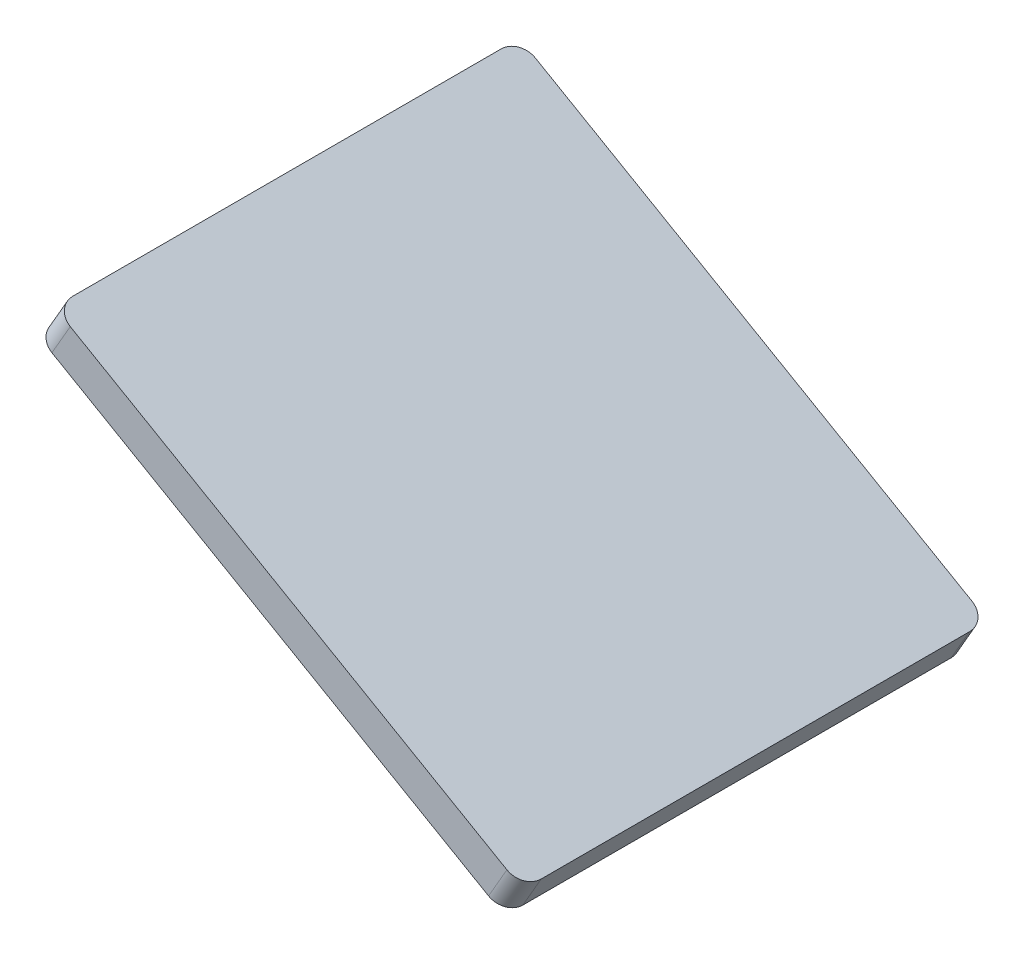
ISO-10303-21;
HEADER;
FILE_DESCRIPTION(('STEP AP214'),'2;1');
FILE_NAME('part.step','',(''),(''),'','','');
FILE_SCHEMA(('AUTOMOTIVE_DESIGN { 1 0 10303 214 1 1 1 1 }'));
ENDSEC;
DATA;
#1=APPLICATION_CONTEXT('core data for automotive mechanical design processes');
#2=APPLICATION_PROTOCOL_DEFINITION('international standard','automotive_design',2000,#1);
#3=PRODUCT_CONTEXT('',#1,'mechanical');
#4=PRODUCT('Part','Part','',(#3));
#5=PRODUCT_RELATED_PRODUCT_CATEGORY('part','',(#4));
#6=PRODUCT_DEFINITION_FORMATION('','',#4);
#7=PRODUCT_DEFINITION_CONTEXT('part definition',#1,'design');
#8=PRODUCT_DEFINITION('design','',#6,#7);
#9=PRODUCT_DEFINITION_SHAPE('','',#8);
#10=(LENGTH_UNIT() NAMED_UNIT(*) SI_UNIT(.MILLI.,.METRE.));
#11=(NAMED_UNIT(*) PLANE_ANGLE_UNIT() SI_UNIT($,.RADIAN.));
#12=(NAMED_UNIT(*) SI_UNIT($,.STERADIAN.) SOLID_ANGLE_UNIT());
#13=UNCERTAINTY_MEASURE_WITH_UNIT(LENGTH_MEASURE(1.E-05),#10,'distance_accuracy_value','');
#14=(GEOMETRIC_REPRESENTATION_CONTEXT(3) GLOBAL_UNCERTAINTY_ASSIGNED_CONTEXT((#13)) GLOBAL_UNIT_ASSIGNED_CONTEXT((#10,
#11,#12)) REPRESENTATION_CONTEXT('',''));
#15=CARTESIAN_POINT('',(0.,0.,0.));
#16=DIRECTION('',(0.,0.,1.));
#17=DIRECTION('',(1.,0.,0.));
#18=AXIS2_PLACEMENT_3D('',#15,#16,#17);
#19=CARTESIAN_POINT('',(784.669872981079,3111.50813088753,-35.));
#20=DIRECTION('',(-0.499999999999994,-0.866025403784442,0.));
#21=DIRECTION('',(0.866025403784442,-0.499999999999994,0.));
#22=AXIS2_PLACEMENT_3D('',#19,#20,#21);
#23=CYLINDRICAL_SURFACE('',#22,3.00000000000002);
#24=CARTESIAN_POINT('',(781.669872981079,3106.31197846482,-35.));
#25=DIRECTION('',(0.499999999999994,0.866025403784442,0.));
#26=DIRECTION('',(-0.866025403784442,0.499999999999994,0.));
#27=AXIS2_PLACEMENT_3D('',#24,#25,#26);
#28=CIRCLE('',#27,3.00000000000002);
#29=CARTESIAN_POINT('',(784.267949192432,3104.81197846482,-35.));
#30=VERTEX_POINT('',#29);
#31=CARTESIAN_POINT('',(781.669872981079,3106.31197846482,-38.));
#32=VERTEX_POINT('',#31);
#33=EDGE_CURVE('E136',#30,#32,#28,.T.);
#34=ORIENTED_EDGE('',*,*,#33,.T.);
#35=DIRECTION('',(-0.499999999999994,-0.866025403784442,0.));
#36=VECTOR('',#35,1.);
#37=CARTESIAN_POINT('',(784.669872981079,3111.50813088753,-38.));
#38=LINE('',#37,#36);
#39=CARTESIAN_POINT('',(784.669872981079,3111.50813088753,-38.));
#40=VERTEX_POINT('',#39);
#41=EDGE_CURVE('E11',#40,#32,#38,.T.);
#42=ORIENTED_EDGE('',*,*,#41,.F.);
#43=CARTESIAN_POINT('',(784.669872981079,3111.50813088753,-35.));
#44=DIRECTION('',(0.499999999999994,0.866025403784442,0.));
#45=DIRECTION('',(-0.866025403784442,0.499999999999994,0.));
#46=AXIS2_PLACEMENT_3D('',#43,#44,#45);
#47=CIRCLE('',#46,3.00000000000002);
#48=CARTESIAN_POINT('',(787.267949192432,3110.00813088753,-35.));
#49=VERTEX_POINT('',#48);
#50=EDGE_CURVE('E150',#49,#40,#47,.T.);
#51=ORIENTED_EDGE('',*,*,#50,.F.);
#52=DIRECTION('',(-0.499999999999994,-0.866025403784442,0.));
#53=VECTOR('',#52,1.);
#54=CARTESIAN_POINT('',(787.267949192432,3110.00813088753,-35.));
#55=LINE('',#54,#53);
#56=EDGE_CURVE('E132',#49,#30,#55,.T.);
#57=ORIENTED_EDGE('',*,*,#56,.T.);
#58=EDGE_LOOP('',(#34,#42,#51,#57));
#59=FACE_BOUND('',#58,.T.);
#60=ADVANCED_FACE('F40',(#59),#23,.T.);
#61=CARTESIAN_POINT('',(713.330127018923,3152.6961524227,-38.));
#62=DIRECTION('',(0.,0.,1.));
#63=DIRECTION('',(1.,0.,0.));
#64=AXIS2_PLACEMENT_3D('',#61,#62,#63);
#65=PLANE('',#64);
#66=DIRECTION('',(-0.866025403784442,0.499999999999994,0.));
#67=VECTOR('',#66,1.);
#68=CARTESIAN_POINT('',(710.330127018923,3147.49999999999,-38.));
#69=LINE('',#68,#67);
#70=CARTESIAN_POINT('',(710.330127018923,3147.49999999999,-38.));
#71=VERTEX_POINT('',#70);
#72=EDGE_CURVE('E139',#32,#71,#69,.T.);
#73=ORIENTED_EDGE('',*,*,#72,.T.);
#74=DIRECTION('',(-0.499999999999994,-0.866025403784442,0.));
#75=VECTOR('',#74,1.);
#76=CARTESIAN_POINT('',(713.330127018923,3152.6961524227,-38.));
#77=LINE('',#76,#75);
#78=CARTESIAN_POINT('',(713.330127018923,3152.6961524227,-38.));
#79=VERTEX_POINT('',#78);
#80=EDGE_CURVE('E48',#79,#71,#77,.T.);
#81=ORIENTED_EDGE('',*,*,#80,.F.);
#82=DIRECTION('',(-0.866025403784442,0.499999999999994,0.));
#83=VECTOR('',#82,1.);
#84=CARTESIAN_POINT('',(713.330127018923,3152.6961524227,-38.));
#85=LINE('',#84,#83);
#86=EDGE_CURVE('E99',#40,#79,#85,.T.);
#87=ORIENTED_EDGE('',*,*,#86,.F.);
#88=ORIENTED_EDGE('',*,*,#41,.T.);
#89=EDGE_LOOP('',(#73,#81,#87,#88));
#90=FACE_BOUND('',#89,.T.);
#91=ADVANCED_FACE('F185',(#90),#65,.F.);
#92=CARTESIAN_POINT('',(713.330127018923,3152.6961524227,-35.));
#93=DIRECTION('',(-0.499999999999994,-0.866025403784442,0.));
#94=DIRECTION('',(0.866025403784442,-0.499999999999994,0.));
#95=AXIS2_PLACEMENT_3D('',#92,#93,#94);
#96=CYLINDRICAL_SURFACE('',#95,3.00000000000002);
#97=CARTESIAN_POINT('',(710.330127018923,3147.49999999999,-35.));
#98=DIRECTION('',(0.499999999999994,0.866025403784442,0.));
#99=DIRECTION('',(0.866025403784442,-0.499999999999994,0.));
#100=AXIS2_PLACEMENT_3D('',#97,#98,#99);
#101=CIRCLE('',#100,3.00000000000002);
#102=CARTESIAN_POINT('',(707.73205080757,3148.99999999999,-35.));
#103=VERTEX_POINT('',#102);
#104=EDGE_CURVE('E141',#71,#103,#101,.T.);
#105=ORIENTED_EDGE('',*,*,#104,.T.);
#106=DIRECTION('',(-0.499999999999994,-0.866025403784442,0.));
#107=VECTOR('',#106,1.);
#108=CARTESIAN_POINT('',(710.73205080757,3154.1961524227,-35.));
#109=LINE('',#108,#107);
#110=CARTESIAN_POINT('',(710.73205080757,3154.1961524227,-35.));
#111=VERTEX_POINT('',#110);
#112=EDGE_CURVE('E157',#111,#103,#109,.T.);
#113=ORIENTED_EDGE('',*,*,#112,.F.);
#114=CARTESIAN_POINT('',(713.330127018923,3152.6961524227,-35.));
#115=DIRECTION('',(0.499999999999994,0.866025403784442,0.));
#116=DIRECTION('',(0.866025403784442,-0.499999999999994,0.));
#117=AXIS2_PLACEMENT_3D('',#114,#115,#116);
#118=CIRCLE('',#117,3.00000000000002);
#119=EDGE_CURVE('E165',#79,#111,#118,.T.);
#120=ORIENTED_EDGE('',*,*,#119,.F.);
#121=ORIENTED_EDGE('',*,*,#80,.T.);
#122=EDGE_LOOP('',(#105,#113,#120,#121));
#123=FACE_BOUND('',#122,.T.);
#124=ADVANCED_FACE('F163',(#123),#96,.T.);
#125=CARTESIAN_POINT('',(710.73205080757,3154.1961524227,-35.));
#126=DIRECTION('',(0.866025403784442,-0.499999999999994,0.));
#127=DIRECTION('',(0.499999999999994,0.866025403784442,0.));
#128=AXIS2_PLACEMENT_3D('',#125,#126,#127);
#129=PLANE('',#128);
#130=DIRECTION('',(0.,0.,1.));
#131=VECTOR('',#130,1.);
#132=CARTESIAN_POINT('',(707.73205080757,3148.99999999999,-35.));
#133=LINE('',#132,#131);
#134=CARTESIAN_POINT('',(707.73205080757,3148.99999999999,35.));
#135=VERTEX_POINT('',#134);
#136=EDGE_CURVE('E143',#103,#135,#133,.T.);
#137=ORIENTED_EDGE('',*,*,#136,.T.);
#138=DIRECTION('',(-0.499999999999994,-0.866025403784442,0.));
#139=VECTOR('',#138,1.);
#140=CARTESIAN_POINT('',(710.73205080757,3154.1961524227,35.));
#141=LINE('',#140,#139);
#142=CARTESIAN_POINT('',(710.73205080757,3154.1961524227,35.));
#143=VERTEX_POINT('',#142);
#144=EDGE_CURVE('E154',#143,#135,#141,.T.);
#145=ORIENTED_EDGE('',*,*,#144,.F.);
#146=DIRECTION('',(0.,0.,1.));
#147=VECTOR('',#146,1.);
#148=CARTESIAN_POINT('',(710.73205080757,3154.1961524227,-35.));
#149=LINE('',#148,#147);
#150=EDGE_CURVE('E177',#111,#143,#149,.T.);
#151=ORIENTED_EDGE('',*,*,#150,.F.);
#152=ORIENTED_EDGE('',*,*,#112,.T.);
#153=EDGE_LOOP('',(#137,#145,#151,#152));
#154=FACE_BOUND('',#153,.T.);
#155=ADVANCED_FACE('F173',(#154),#129,.F.);
#156=CARTESIAN_POINT('',(713.330127018923,3152.6961524227,35.));
#157=DIRECTION('',(-0.499999999999994,-0.866025403784442,0.));
#158=DIRECTION('',(0.866025403784442,-0.499999999999994,0.));
#159=AXIS2_PLACEMENT_3D('',#156,#157,#158);
#160=CYLINDRICAL_SURFACE('',#159,3.00000000000002);
#161=CARTESIAN_POINT('',(710.330127018923,3147.49999999999,35.));
#162=DIRECTION('',(0.499999999999994,0.866025403784442,0.));
#163=DIRECTION('',(0.866025403784442,-0.499999999999994,0.));
#164=AXIS2_PLACEMENT_3D('',#161,#162,#163);
#165=CIRCLE('',#164,3.00000000000002);
#166=CARTESIAN_POINT('',(710.330127018923,3147.49999999999,38.));
#167=VERTEX_POINT('',#166);
#168=EDGE_CURVE('E145',#135,#167,#165,.T.);
#169=ORIENTED_EDGE('',*,*,#168,.T.);
#170=DIRECTION('',(-0.499999999999994,-0.866025403784442,0.));
#171=VECTOR('',#170,1.);
#172=CARTESIAN_POINT('',(713.330127018923,3152.6961524227,38.));
#173=LINE('',#172,#171);
#174=CARTESIAN_POINT('',(713.330127018923,3152.6961524227,38.));
#175=VERTEX_POINT('',#174);
#176=EDGE_CURVE('E127',#175,#167,#173,.T.);
#177=ORIENTED_EDGE('',*,*,#176,.F.);
#178=CARTESIAN_POINT('',(713.330127018923,3152.6961524227,35.));
#179=DIRECTION('',(0.499999999999994,0.866025403784442,0.));
#180=DIRECTION('',(0.866025403784442,-0.499999999999994,0.));
#181=AXIS2_PLACEMENT_3D('',#178,#179,#180);
#182=CIRCLE('',#181,3.00000000000002);
#183=EDGE_CURVE('E118',#143,#175,#182,.T.);
#184=ORIENTED_EDGE('',*,*,#183,.F.);
#185=ORIENTED_EDGE('',*,*,#144,.T.);
#186=EDGE_LOOP('',(#169,#177,#184,#185));
#187=FACE_BOUND('',#186,.T.);
#188=ADVANCED_FACE('F176',(#187),#160,.T.);
#189=CARTESIAN_POINT('',(713.330127018923,3152.6961524227,38.));
#190=DIRECTION('',(0.,0.,-1.));
#191=DIRECTION('',(-1.,0.,0.));
#192=AXIS2_PLACEMENT_3D('',#189,#190,#191);
#193=PLANE('',#192);
#194=DIRECTION('',(0.866025403784442,-0.499999999999994,0.));
#195=VECTOR('',#194,1.);
#196=CARTESIAN_POINT('',(710.330127018923,3147.49999999999,38.));
#197=LINE('',#196,#195);
#198=CARTESIAN_POINT('',(781.669872981079,3106.31197846482,38.));
#199=VERTEX_POINT('',#198);
#200=EDGE_CURVE('E126',#167,#199,#197,.T.);
#201=ORIENTED_EDGE('',*,*,#200,.T.);
#202=DIRECTION('',(-0.499999999999994,-0.866025403784442,0.));
#203=VECTOR('',#202,1.);
#204=CARTESIAN_POINT('',(784.669872981079,3111.50813088753,38.));
#205=LINE('',#204,#203);
#206=CARTESIAN_POINT('',(784.669872981079,3111.50813088753,38.));
#207=VERTEX_POINT('',#206);
#208=EDGE_CURVE('E123',#207,#199,#205,.T.);
#209=ORIENTED_EDGE('',*,*,#208,.F.);
#210=DIRECTION('',(0.866025403784442,-0.499999999999994,0.));
#211=VECTOR('',#210,1.);
#212=CARTESIAN_POINT('',(713.330127018923,3152.6961524227,38.));
#213=LINE('',#212,#211);
#214=EDGE_CURVE('E112',#175,#207,#213,.T.);
#215=ORIENTED_EDGE('',*,*,#214,.F.);
#216=ORIENTED_EDGE('',*,*,#176,.T.);
#217=EDGE_LOOP('',(#201,#209,#215,#216));
#218=FACE_BOUND('',#217,.T.);
#219=ADVANCED_FACE('F124',(#218),#193,.F.);
#220=CARTESIAN_POINT('',(784.669872981079,3111.50813088753,35.));
#221=DIRECTION('',(-0.499999999999994,-0.866025403784442,0.));
#222=DIRECTION('',(0.866025403784442,-0.499999999999994,0.));
#223=AXIS2_PLACEMENT_3D('',#220,#221,#222);
#224=CYLINDRICAL_SURFACE('',#223,3.00000000000002);
#225=CARTESIAN_POINT('',(781.669872981079,3106.31197846482,35.));
#226=DIRECTION('',(0.499999999999994,0.866025403784442,0.));
#227=DIRECTION('',(0.866025403784442,-0.499999999999994,0.));
#228=AXIS2_PLACEMENT_3D('',#225,#226,#227);
#229=CIRCLE('',#228,3.00000000000002);
#230=CARTESIAN_POINT('',(784.267949192432,3104.81197846482,35.));
#231=VERTEX_POINT('',#230);
#232=EDGE_CURVE('E85',#199,#231,#229,.T.);
#233=ORIENTED_EDGE('',*,*,#232,.T.);
#234=DIRECTION('',(-0.499999999999994,-0.866025403784442,0.));
#235=VECTOR('',#234,1.);
#236=CARTESIAN_POINT('',(787.267949192432,3110.00813088753,35.));
#237=LINE('',#236,#235);
#238=CARTESIAN_POINT('',(787.267949192432,3110.00813088753,35.));
#239=VERTEX_POINT('',#238);
#240=EDGE_CURVE('E128',#239,#231,#237,.T.);
#241=ORIENTED_EDGE('',*,*,#240,.F.);
#242=CARTESIAN_POINT('',(784.669872981079,3111.50813088753,35.));
#243=DIRECTION('',(0.499999999999994,0.866025403784442,0.));
#244=DIRECTION('',(0.866025403784442,-0.499999999999994,0.));
#245=AXIS2_PLACEMENT_3D('',#242,#243,#244);
#246=CIRCLE('',#245,3.00000000000002);
#247=EDGE_CURVE('E116',#207,#239,#246,.T.);
#248=ORIENTED_EDGE('',*,*,#247,.F.);
#249=ORIENTED_EDGE('',*,*,#208,.T.);
#250=EDGE_LOOP('',(#233,#241,#248,#249));
#251=FACE_BOUND('',#250,.T.);
#252=ADVANCED_FACE('F130',(#251),#224,.T.);
#253=CARTESIAN_POINT('',(787.267949192432,3110.00813088753,-35.));
#254=DIRECTION('',(-0.866025403784442,0.499999999999994,0.));
#255=DIRECTION('',(-0.499999999999994,-0.866025403784442,0.));
#256=AXIS2_PLACEMENT_3D('',#253,#254,#255);
#257=PLANE('',#256);
#258=DIRECTION('',(0.,0.,-1.));
#259=VECTOR('',#258,1.);
#260=CARTESIAN_POINT('',(784.267949192432,3104.81197846482,-35.));
#261=LINE('',#260,#259);
#262=EDGE_CURVE('E91',#231,#30,#261,.T.);
#263=ORIENTED_EDGE('',*,*,#262,.T.);
#264=ORIENTED_EDGE('',*,*,#56,.F.);
#265=DIRECTION('',(0.,0.,-1.));
#266=VECTOR('',#265,1.);
#267=CARTESIAN_POINT('',(787.267949192432,3110.00813088753,-35.));
#268=LINE('',#267,#266);
#269=EDGE_CURVE('E56',#239,#49,#268,.T.);
#270=ORIENTED_EDGE('',*,*,#269,.F.);
#271=ORIENTED_EDGE('',*,*,#240,.T.);
#272=EDGE_LOOP('',(#263,#264,#270,#271));
#273=FACE_BOUND('',#272,.T.);
#274=ADVANCED_FACE('F201',(#273),#257,.F.);
#275=CARTESIAN_POINT('',(784.669872981079,3111.50813088753,-35.));
#276=DIRECTION('',(0.499999999999994,0.866025403784442,0.));
#277=DIRECTION('',(-0.866025403784442,0.499999999999994,0.));
#278=AXIS2_PLACEMENT_3D('',#275,#276,#277);
#279=PLANE('',#278);
#280=ORIENTED_EDGE('',*,*,#50,.T.);
#281=ORIENTED_EDGE('',*,*,#86,.T.);
#282=ORIENTED_EDGE('',*,*,#119,.T.);
#283=ORIENTED_EDGE('',*,*,#150,.T.);
#284=ORIENTED_EDGE('',*,*,#183,.T.);
#285=ORIENTED_EDGE('',*,*,#214,.T.);
#286=ORIENTED_EDGE('',*,*,#247,.T.);
#287=ORIENTED_EDGE('',*,*,#269,.T.);
#288=EDGE_LOOP('',(#280,#281,#282,#283,#284,#285,#286,#287));
#289=FACE_BOUND('',#288,.T.);
#290=ADVANCED_FACE('F114',(#289),#279,.T.);
#291=CARTESIAN_POINT('',(781.669872981079,3106.31197846482,-35.));
#292=DIRECTION('',(0.499999999999994,0.866025403784442,0.));
#293=DIRECTION('',(-0.866025403784442,0.499999999999994,0.));
#294=AXIS2_PLACEMENT_3D('',#291,#292,#293);
#295=PLANE('',#294);
#296=ORIENTED_EDGE('',*,*,#33,.F.);
#297=ORIENTED_EDGE('',*,*,#262,.F.);
#298=ORIENTED_EDGE('',*,*,#232,.F.);
#299=ORIENTED_EDGE('',*,*,#200,.F.);
#300=ORIENTED_EDGE('',*,*,#168,.F.);
#301=ORIENTED_EDGE('',*,*,#136,.F.);
#302=ORIENTED_EDGE('',*,*,#104,.F.);
#303=ORIENTED_EDGE('',*,*,#72,.F.);
#304=EDGE_LOOP('',(#296,#297,#298,#299,#300,#301,#302,#303));
#305=FACE_BOUND('',#304,.T.);
#306=ADVANCED_FACE('F169',(#305),#295,.F.);
#307=CLOSED_SHELL('',(#60,#91,#124,#155,#188,#219,#252,#274,#290,#306));
#308=MANIFOLD_SOLID_BREP('B2',#307);
#309=ADVANCED_BREP_SHAPE_REPRESENTATION('',(#18,#308),#14);
#310=SHAPE_DEFINITION_REPRESENTATION(#9,#309);
ENDSEC;
END-ISO-10303-21;
